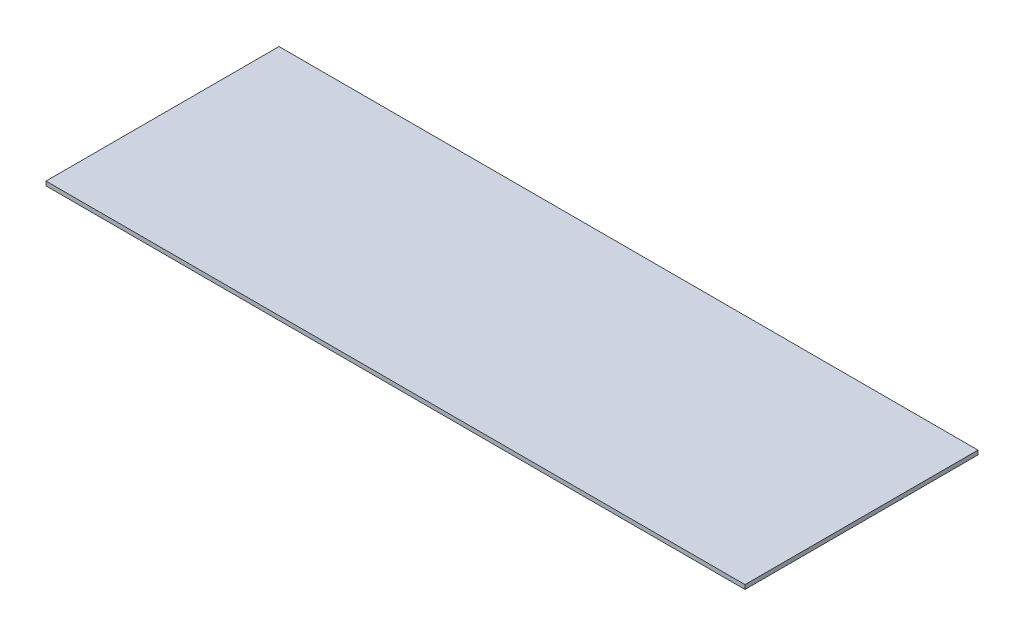
ISO-10303-21;
HEADER;
FILE_DESCRIPTION(('STEP AP214'),'2;1');
FILE_NAME('part.step','',(''),(''),'','','');
FILE_SCHEMA(('AUTOMOTIVE_DESIGN { 1 0 10303 214 1 1 1 1 }'));
ENDSEC;
DATA;
#1=APPLICATION_CONTEXT('core data for automotive mechanical design processes');
#2=APPLICATION_PROTOCOL_DEFINITION('international standard','automotive_design',2000,#1);
#3=PRODUCT_CONTEXT('',#1,'mechanical');
#4=PRODUCT('Part','Part','',(#3));
#5=PRODUCT_RELATED_PRODUCT_CATEGORY('part','',(#4));
#6=PRODUCT_DEFINITION_FORMATION('','',#4);
#7=PRODUCT_DEFINITION_CONTEXT('part definition',#1,'design');
#8=PRODUCT_DEFINITION('design','',#6,#7);
#9=PRODUCT_DEFINITION_SHAPE('','',#8);
#10=(LENGTH_UNIT() NAMED_UNIT(*) SI_UNIT(.MILLI.,.METRE.));
#11=(NAMED_UNIT(*) PLANE_ANGLE_UNIT() SI_UNIT($,.RADIAN.));
#12=(NAMED_UNIT(*) SI_UNIT($,.STERADIAN.) SOLID_ANGLE_UNIT());
#13=UNCERTAINTY_MEASURE_WITH_UNIT(LENGTH_MEASURE(1.E-05),#10,'distance_accuracy_value','');
#14=(GEOMETRIC_REPRESENTATION_CONTEXT(3) GLOBAL_UNCERTAINTY_ASSIGNED_CONTEXT((#13)) GLOBAL_UNIT_ASSIGNED_CONTEXT((#10,
#11,#12)) REPRESENTATION_CONTEXT('',''));
#15=CARTESIAN_POINT('',(0.,0.,0.));
#16=DIRECTION('',(0.,0.,1.));
#17=DIRECTION('',(1.,0.,0.));
#18=AXIS2_PLACEMENT_3D('',#15,#16,#17);
#19=CARTESIAN_POINT('',(0.,1.8,0.));
#20=DIRECTION('',(1.,0.,0.));
#21=DIRECTION('',(0.,0.,-1.));
#22=AXIS2_PLACEMENT_3D('',#19,#20,#21);
#23=PLANE('',#22);
#24=DIRECTION('',(0.,0.,1.));
#25=VECTOR('',#24,1.);
#26=CARTESIAN_POINT('',(0.,0.,0.));
#27=LINE('',#26,#25);
#28=CARTESIAN_POINT('',(0.,0.,-100.));
#29=VERTEX_POINT('',#28);
#30=CARTESIAN_POINT('',(0.,0.,0.));
#31=VERTEX_POINT('',#30);
#32=EDGE_CURVE('E98',#29,#31,#27,.T.);
#33=ORIENTED_EDGE('',*,*,#32,.T.);
#34=DIRECTION('',(0.,-1.,0.));
#35=VECTOR('',#34,1.);
#36=CARTESIAN_POINT('',(0.,1.8,0.));
#37=LINE('',#36,#35);
#38=CARTESIAN_POINT('',(0.,1.8,0.));
#39=VERTEX_POINT('',#38);
#40=EDGE_CURVE('E11',#39,#31,#37,.T.);
#41=ORIENTED_EDGE('',*,*,#40,.F.);
#42=DIRECTION('',(0.,0.,1.));
#43=VECTOR('',#42,1.);
#44=CARTESIAN_POINT('',(0.,1.8,0.));
#45=LINE('',#44,#43);
#46=CARTESIAN_POINT('',(0.,1.8,-100.));
#47=VERTEX_POINT('',#46);
#48=EDGE_CURVE('E86',#47,#39,#45,.T.);
#49=ORIENTED_EDGE('',*,*,#48,.F.);
#50=DIRECTION('',(0.,-1.,0.));
#51=VECTOR('',#50,1.);
#52=CARTESIAN_POINT('',(0.,1.8,-100.));
#53=LINE('',#52,#51);
#54=EDGE_CURVE('E94',#47,#29,#53,.T.);
#55=ORIENTED_EDGE('',*,*,#54,.T.);
#56=EDGE_LOOP('',(#33,#41,#49,#55));
#57=FACE_BOUND('',#56,.T.);
#58=ADVANCED_FACE('F35',(#57),#23,.F.);
#59=CARTESIAN_POINT('',(0.,1.8,0.));
#60=DIRECTION('',(0.,0.,-1.));
#61=DIRECTION('',(-1.,0.,0.));
#62=AXIS2_PLACEMENT_3D('',#59,#60,#61);
#63=PLANE('',#62);
#64=DIRECTION('',(1.,0.,0.));
#65=VECTOR('',#64,1.);
#66=CARTESIAN_POINT('',(0.,0.,0.));
#67=LINE('',#66,#65);
#68=CARTESIAN_POINT('',(300.,0.,0.));
#69=VERTEX_POINT('',#68);
#70=EDGE_CURVE('E90',#31,#69,#67,.T.);
#71=ORIENTED_EDGE('',*,*,#70,.T.);
#72=DIRECTION('',(0.,-1.,0.));
#73=VECTOR('',#72,1.);
#74=CARTESIAN_POINT('',(300.,1.8,0.));
#75=LINE('',#74,#73);
#76=CARTESIAN_POINT('',(300.,1.8,0.));
#77=VERTEX_POINT('',#76);
#78=EDGE_CURVE('E43',#77,#69,#75,.T.);
#79=ORIENTED_EDGE('',*,*,#78,.F.);
#80=DIRECTION('',(1.,0.,0.));
#81=VECTOR('',#80,1.);
#82=CARTESIAN_POINT('',(0.,1.8,0.));
#83=LINE('',#82,#81);
#84=EDGE_CURVE('E81',#39,#77,#83,.T.);
#85=ORIENTED_EDGE('',*,*,#84,.F.);
#86=ORIENTED_EDGE('',*,*,#40,.T.);
#87=EDGE_LOOP('',(#71,#79,#85,#86));
#88=FACE_BOUND('',#87,.T.);
#89=ADVANCED_FACE('F89',(#88),#63,.F.);
#90=CARTESIAN_POINT('',(300.,1.8,0.));
#91=DIRECTION('',(-1.,0.,0.));
#92=DIRECTION('',(0.,0.,1.));
#93=AXIS2_PLACEMENT_3D('',#90,#91,#92);
#94=PLANE('',#93);
#95=DIRECTION('',(0.,0.,-1.));
#96=VECTOR('',#95,1.);
#97=CARTESIAN_POINT('',(300.,0.,0.));
#98=LINE('',#97,#96);
#99=CARTESIAN_POINT('',(300.,0.,-100.));
#100=VERTEX_POINT('',#99);
#101=EDGE_CURVE('E68',#69,#100,#98,.T.);
#102=ORIENTED_EDGE('',*,*,#101,.T.);
#103=DIRECTION('',(0.,-1.,0.));
#104=VECTOR('',#103,1.);
#105=CARTESIAN_POINT('',(300.,1.8,-100.));
#106=LINE('',#105,#104);
#107=CARTESIAN_POINT('',(300.,1.8,-100.));
#108=VERTEX_POINT('',#107);
#109=EDGE_CURVE('E91',#108,#100,#106,.T.);
#110=ORIENTED_EDGE('',*,*,#109,.F.);
#111=DIRECTION('',(0.,0.,-1.));
#112=VECTOR('',#111,1.);
#113=CARTESIAN_POINT('',(300.,1.8,0.));
#114=LINE('',#113,#112);
#115=EDGE_CURVE('E84',#77,#108,#114,.T.);
#116=ORIENTED_EDGE('',*,*,#115,.F.);
#117=ORIENTED_EDGE('',*,*,#78,.T.);
#118=EDGE_LOOP('',(#102,#110,#116,#117));
#119=FACE_BOUND('',#118,.T.);
#120=ADVANCED_FACE('F92',(#119),#94,.F.);
#121=CARTESIAN_POINT('',(0.,1.8,-100.));
#122=DIRECTION('',(0.,0.,1.));
#123=DIRECTION('',(1.,0.,0.));
#124=AXIS2_PLACEMENT_3D('',#121,#122,#123);
#125=PLANE('',#124);
#126=DIRECTION('',(-1.,0.,0.));
#127=VECTOR('',#126,1.);
#128=CARTESIAN_POINT('',(0.,0.,-100.));
#129=LINE('',#128,#127);
#130=EDGE_CURVE('E74',#100,#29,#129,.T.);
#131=ORIENTED_EDGE('',*,*,#130,.T.);
#132=ORIENTED_EDGE('',*,*,#54,.F.);
#133=DIRECTION('',(-1.,0.,0.));
#134=VECTOR('',#133,1.);
#135=CARTESIAN_POINT('',(0.,1.8,-100.));
#136=LINE('',#135,#134);
#137=EDGE_CURVE('E51',#108,#47,#136,.T.);
#138=ORIENTED_EDGE('',*,*,#137,.F.);
#139=ORIENTED_EDGE('',*,*,#109,.T.);
#140=EDGE_LOOP('',(#131,#132,#138,#139));
#141=FACE_BOUND('',#140,.T.);
#142=ADVANCED_FACE('F105',(#141),#125,.F.);
#143=CARTESIAN_POINT('',(0.,1.8,0.));
#144=DIRECTION('',(0.,-1.,0.));
#145=DIRECTION('',(0.,0.,-1.));
#146=AXIS2_PLACEMENT_3D('',#143,#144,#145);
#147=PLANE('',#146);
#148=ORIENTED_EDGE('',*,*,#48,.T.);
#149=ORIENTED_EDGE('',*,*,#84,.T.);
#150=ORIENTED_EDGE('',*,*,#115,.T.);
#151=ORIENTED_EDGE('',*,*,#137,.T.);
#152=EDGE_LOOP('',(#148,#149,#150,#151));
#153=FACE_BOUND('',#152,.T.);
#154=ADVANCED_FACE('F82',(#153),#147,.F.);
#155=CARTESIAN_POINT('',(0.,0.,0.));
#156=DIRECTION('',(0.,-1.,0.));
#157=DIRECTION('',(0.,0.,-1.));
#158=AXIS2_PLACEMENT_3D('',#155,#156,#157);
#159=PLANE('',#158);
#160=ORIENTED_EDGE('',*,*,#32,.F.);
#161=ORIENTED_EDGE('',*,*,#130,.F.);
#162=ORIENTED_EDGE('',*,*,#101,.F.);
#163=ORIENTED_EDGE('',*,*,#70,.F.);
#164=EDGE_LOOP('',(#160,#161,#162,#163));
#165=FACE_BOUND('',#164,.T.);
#166=ADVANCED_FACE('F108',(#165),#159,.T.);
#167=CLOSED_SHELL('',(#58,#89,#120,#142,#154,#166));
#168=MANIFOLD_SOLID_BREP('B2',#167);
#169=ADVANCED_BREP_SHAPE_REPRESENTATION('',(#18,#168),#14);
#170=SHAPE_DEFINITION_REPRESENTATION(#9,#169);
ENDSEC;
END-ISO-10303-21;
